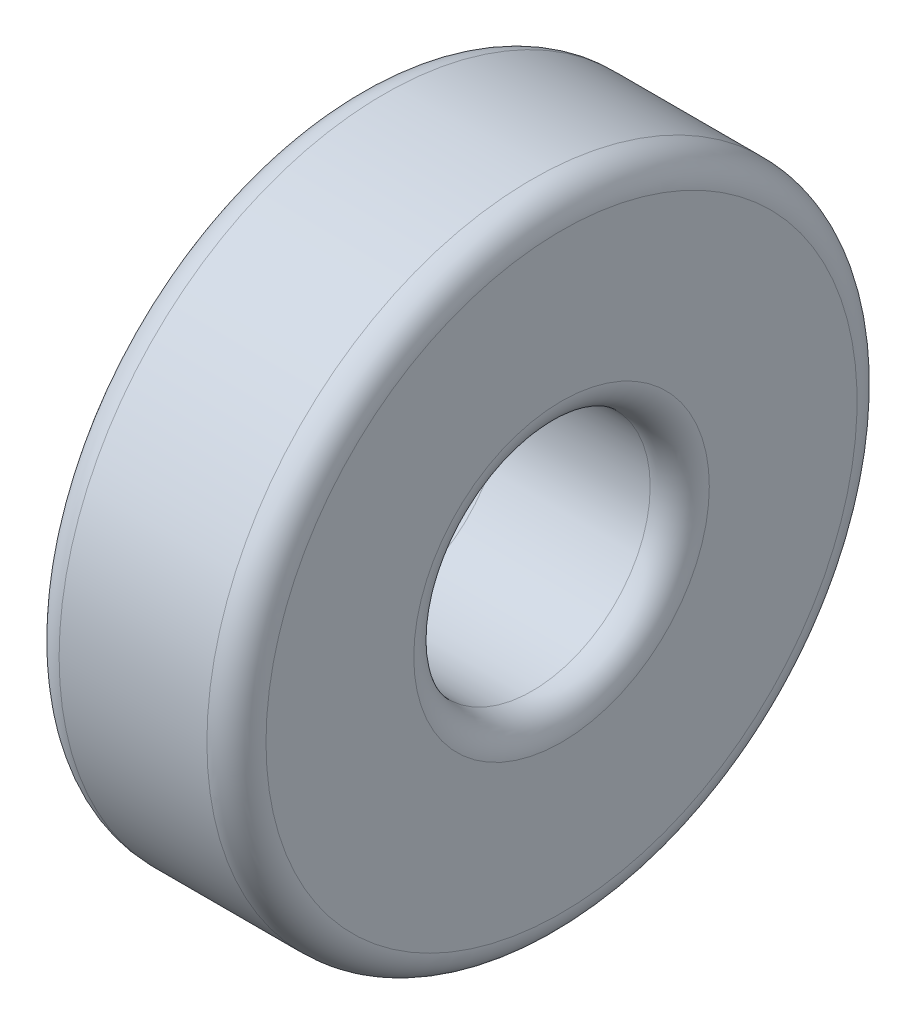
ISO-10303-21;
HEADER;
FILE_DESCRIPTION(('STEP AP214'),'2;1');
FILE_NAME('part.step','',(''),(''),'','','');
FILE_SCHEMA(('AUTOMOTIVE_DESIGN { 1 0 10303 214 1 1 1 1 }'));
ENDSEC;
DATA;
#1=APPLICATION_CONTEXT('core data for automotive mechanical design processes');
#2=APPLICATION_PROTOCOL_DEFINITION('international standard','automotive_design',2000,#1);
#3=PRODUCT_CONTEXT('',#1,'mechanical');
#4=PRODUCT('Part','Part','',(#3));
#5=PRODUCT_RELATED_PRODUCT_CATEGORY('part','',(#4));
#6=PRODUCT_DEFINITION_FORMATION('','',#4);
#7=PRODUCT_DEFINITION_CONTEXT('part definition',#1,'design');
#8=PRODUCT_DEFINITION('design','',#6,#7);
#9=PRODUCT_DEFINITION_SHAPE('','',#8);
#10=(LENGTH_UNIT() NAMED_UNIT(*) SI_UNIT(.MILLI.,.METRE.));
#11=(NAMED_UNIT(*) PLANE_ANGLE_UNIT() SI_UNIT($,.RADIAN.));
#12=(NAMED_UNIT(*) SI_UNIT($,.STERADIAN.) SOLID_ANGLE_UNIT());
#13=UNCERTAINTY_MEASURE_WITH_UNIT(LENGTH_MEASURE(1.E-05),#10,'distance_accuracy_value','');
#14=(GEOMETRIC_REPRESENTATION_CONTEXT(3) GLOBAL_UNCERTAINTY_ASSIGNED_CONTEXT((#13)) GLOBAL_UNIT_ASSIGNED_CONTEXT((#10,
#11,#12)) REPRESENTATION_CONTEXT('',''));
#15=CARTESIAN_POINT('',(0.,0.,0.));
#16=DIRECTION('',(0.,0.,1.));
#17=DIRECTION('',(1.,0.,0.));
#18=AXIS2_PLACEMENT_3D('',#15,#16,#17);
#19=CARTESIAN_POINT('',(-3.5,11.,0.));
#20=DIRECTION('',(1.,0.,0.));
#21=DIRECTION('',(0.,0.,-1.));
#22=AXIS2_PLACEMENT_3D('',#19,#20,#21);
#23=PLANE('',#22);
#24=CARTESIAN_POINT('',(-3.5,0.,0.));
#25=DIRECTION('',(1.,0.,0.));
#26=DIRECTION('',(0.,0.,-1.));
#27=AXIS2_PLACEMENT_3D('',#24,#25,#26);
#28=CIRCLE('',#27,10.);
#29=CARTESIAN_POINT('',(-3.5,0.,-10.));
#30=VERTEX_POINT('',#29);
#31=EDGE_CURVE('E10',#30,#30,#28,.F.);
#32=ORIENTED_EDGE('',*,*,#31,.T.);
#33=EDGE_LOOP('',(#32));
#34=FACE_BOUND('',#33,.T.);
#35=CARTESIAN_POINT('',(-3.5,0.,0.));
#36=DIRECTION('',(1.,0.,0.));
#37=DIRECTION('',(0.,0.,-1.));
#38=AXIS2_PLACEMENT_3D('',#35,#36,#37);
#39=CIRCLE('',#38,5.);
#40=CARTESIAN_POINT('',(-3.5,0.,-5.));
#41=VERTEX_POINT('',#40);
#42=EDGE_CURVE('E37',#41,#41,#39,.T.);
#43=ORIENTED_EDGE('',*,*,#42,.T.);
#44=EDGE_LOOP('',(#43));
#45=FACE_BOUND('',#44,.T.);
#46=ADVANCED_FACE('F30',(#34,#45),#23,.F.);
#47=CARTESIAN_POINT('',(0.,0.,0.));
#48=DIRECTION('',(-1.,0.,0.));
#49=DIRECTION('',(0.,0.,1.));
#50=AXIS2_PLACEMENT_3D('',#47,#48,#49);
#51=CYLINDRICAL_SURFACE('',#50,11.);
#52=CARTESIAN_POINT('',(2.5,0.,0.));
#53=DIRECTION('',(-1.,0.,0.));
#54=DIRECTION('',(0.,0.,1.));
#55=AXIS2_PLACEMENT_3D('',#52,#53,#54);
#56=CIRCLE('',#55,11.);
#57=CARTESIAN_POINT('',(2.5,0.,11.));
#58=VERTEX_POINT('',#57);
#59=EDGE_CURVE('E41',#58,#58,#56,.T.);
#60=ORIENTED_EDGE('',*,*,#59,.T.);
#61=EDGE_LOOP('',(#60));
#62=FACE_BOUND('',#61,.T.);
#63=CARTESIAN_POINT('',(-2.5,0.,0.));
#64=DIRECTION('',(1.,0.,0.));
#65=DIRECTION('',(0.,0.,-1.));
#66=AXIS2_PLACEMENT_3D('',#63,#64,#65);
#67=CIRCLE('',#66,11.);
#68=CARTESIAN_POINT('',(-2.5,0.,-11.));
#69=VERTEX_POINT('',#68);
#70=EDGE_CURVE('E45',#69,#69,#67,.T.);
#71=ORIENTED_EDGE('',*,*,#70,.T.);
#72=EDGE_LOOP('',(#71));
#73=FACE_BOUND('',#72,.T.);
#74=ADVANCED_FACE('F73',(#62,#73),#51,.T.);
#75=CARTESIAN_POINT('',(3.5,11.,0.));
#76=DIRECTION('',(-1.,0.,0.));
#77=DIRECTION('',(0.,0.,1.));
#78=AXIS2_PLACEMENT_3D('',#75,#76,#77);
#79=PLANE('',#78);
#80=CARTESIAN_POINT('',(3.5,0.,0.));
#81=DIRECTION('',(-1.,0.,0.));
#82=DIRECTION('',(0.,0.,1.));
#83=AXIS2_PLACEMENT_3D('',#80,#81,#82);
#84=CIRCLE('',#83,5.);
#85=CARTESIAN_POINT('',(3.5,0.,5.));
#86=VERTEX_POINT('',#85);
#87=EDGE_CURVE('E56',#86,#86,#84,.T.);
#88=ORIENTED_EDGE('',*,*,#87,.T.);
#89=EDGE_LOOP('',(#88));
#90=FACE_BOUND('',#89,.T.);
#91=CARTESIAN_POINT('',(3.5,0.,0.));
#92=DIRECTION('',(-1.,0.,0.));
#93=DIRECTION('',(0.,0.,1.));
#94=AXIS2_PLACEMENT_3D('',#91,#92,#93);
#95=CIRCLE('',#94,10.);
#96=CARTESIAN_POINT('',(3.5,0.,10.));
#97=VERTEX_POINT('',#96);
#98=EDGE_CURVE('E59',#97,#97,#95,.F.);
#99=ORIENTED_EDGE('',*,*,#98,.T.);
#100=EDGE_LOOP('',(#99));
#101=FACE_BOUND('',#100,.T.);
#102=ADVANCED_FACE('F63',(#90,#101),#79,.F.);
#103=CARTESIAN_POINT('',(0.,0.,0.));
#104=DIRECTION('',(-1.,0.,0.));
#105=DIRECTION('',(0.,0.,1.));
#106=AXIS2_PLACEMENT_3D('',#103,#104,#105);
#107=CYLINDRICAL_SURFACE('',#106,4.);
#108=CARTESIAN_POINT('',(2.5,0.,0.));
#109=DIRECTION('',(-1.,0.,0.));
#110=DIRECTION('',(0.,0.,1.));
#111=AXIS2_PLACEMENT_3D('',#108,#109,#110);
#112=CIRCLE('',#111,4.);
#113=CARTESIAN_POINT('',(2.5,0.,4.));
#114=VERTEX_POINT('',#113);
#115=EDGE_CURVE('E50',#114,#114,#112,.F.);
#116=ORIENTED_EDGE('',*,*,#115,.T.);
#117=EDGE_LOOP('',(#116));
#118=FACE_BOUND('',#117,.T.);
#119=CARTESIAN_POINT('',(-2.5,0.,0.));
#120=DIRECTION('',(1.,0.,0.));
#121=DIRECTION('',(0.,0.,-1.));
#122=AXIS2_PLACEMENT_3D('',#119,#120,#121);
#123=CIRCLE('',#122,4.);
#124=CARTESIAN_POINT('',(-2.5,0.,-4.));
#125=VERTEX_POINT('',#124);
#126=EDGE_CURVE('E53',#125,#125,#123,.F.);
#127=ORIENTED_EDGE('',*,*,#126,.T.);
#128=EDGE_LOOP('',(#127));
#129=FACE_BOUND('',#128,.T.);
#130=ADVANCED_FACE('F92',(#118,#129),#107,.F.);
#131=CARTESIAN_POINT('',(2.5,0.,0.));
#132=DIRECTION('',(-1.,0.,0.));
#133=DIRECTION('',(0.,0.,1.));
#134=AXIS2_PLACEMENT_3D('',#131,#132,#133);
#135=TOROIDAL_SURFACE('',#134,5.,1.);
#136=ORIENTED_EDGE('',*,*,#115,.F.);
#137=EDGE_LOOP('',(#136));
#138=FACE_BOUND('',#137,.T.);
#139=ORIENTED_EDGE('',*,*,#87,.F.);
#140=EDGE_LOOP('',(#139));
#141=FACE_BOUND('',#140,.T.);
#142=ADVANCED_FACE('F69',(#138,#141),#135,.T.);
#143=CARTESIAN_POINT('',(2.5,0.,0.));
#144=DIRECTION('',(-1.,0.,0.));
#145=DIRECTION('',(0.,0.,1.));
#146=AXIS2_PLACEMENT_3D('',#143,#144,#145);
#147=TOROIDAL_SURFACE('',#146,10.,1.);
#148=ORIENTED_EDGE('',*,*,#98,.F.);
#149=EDGE_LOOP('',(#148));
#150=FACE_BOUND('',#149,.T.);
#151=ORIENTED_EDGE('',*,*,#59,.F.);
#152=EDGE_LOOP('',(#151));
#153=FACE_BOUND('',#152,.T.);
#154=ADVANCED_FACE('F65',(#150,#153),#147,.T.);
#155=CARTESIAN_POINT('',(-2.5,0.,0.));
#156=DIRECTION('',(1.,0.,0.));
#157=DIRECTION('',(0.,0.,-1.));
#158=AXIS2_PLACEMENT_3D('',#155,#156,#157);
#159=TOROIDAL_SURFACE('',#158,10.,1.);
#160=ORIENTED_EDGE('',*,*,#70,.F.);
#161=EDGE_LOOP('',(#160));
#162=FACE_BOUND('',#161,.T.);
#163=ORIENTED_EDGE('',*,*,#31,.F.);
#164=EDGE_LOOP('',(#163));
#165=FACE_BOUND('',#164,.T.);
#166=ADVANCED_FACE('F68',(#162,#165),#159,.T.);
#167=CARTESIAN_POINT('',(-2.5,0.,0.));
#168=DIRECTION('',(1.,0.,0.));
#169=DIRECTION('',(0.,0.,-1.));
#170=AXIS2_PLACEMENT_3D('',#167,#168,#169);
#171=TOROIDAL_SURFACE('',#170,5.,1.);
#172=ORIENTED_EDGE('',*,*,#42,.F.);
#173=EDGE_LOOP('',(#172));
#174=FACE_BOUND('',#173,.T.);
#175=ORIENTED_EDGE('',*,*,#126,.F.);
#176=EDGE_LOOP('',(#175));
#177=FACE_BOUND('',#176,.T.);
#178=ADVANCED_FACE('F32',(#174,#177),#171,.T.);
#179=CLOSED_SHELL('',(#46,#74,#102,#130,#142,#154,#166,#178));
#180=MANIFOLD_SOLID_BREP('B2',#179);
#181=ADVANCED_BREP_SHAPE_REPRESENTATION('',(#18,#180),#14);
#182=SHAPE_DEFINITION_REPRESENTATION(#9,#181);
ENDSEC;
END-ISO-10303-21;
